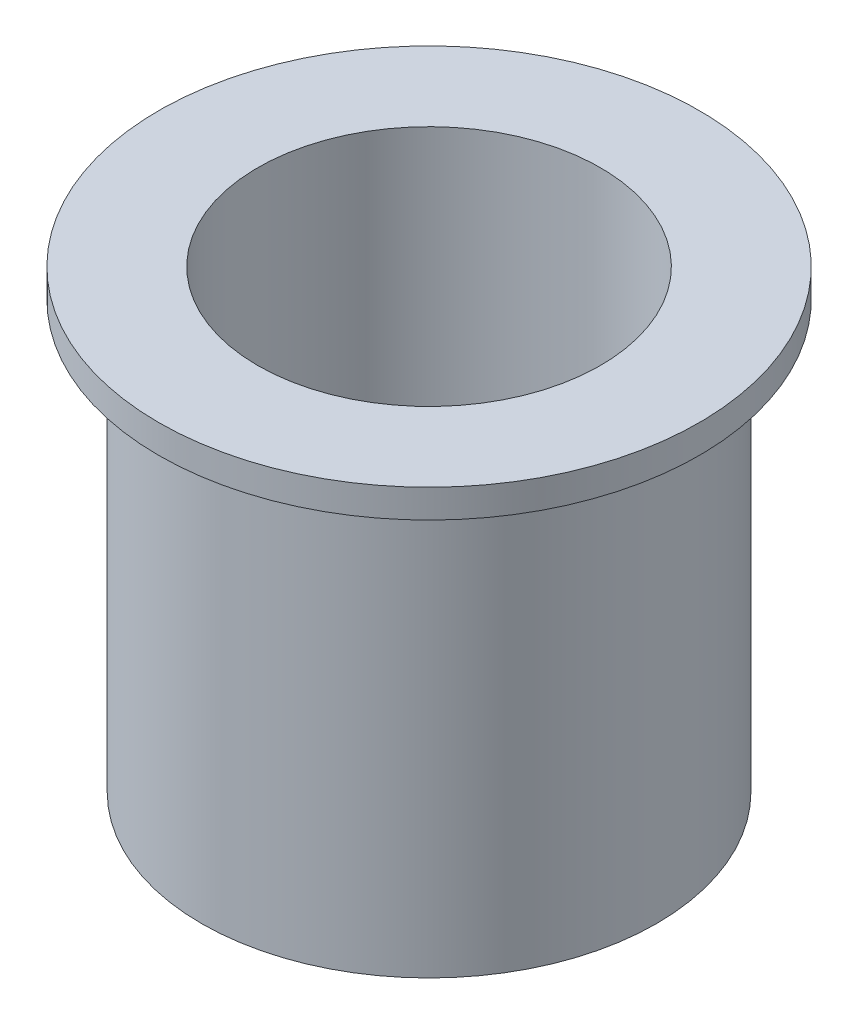
ISO-10303-21;
HEADER;
FILE_DESCRIPTION(('STEP AP214'),'2;1');
FILE_NAME('part.step','',(''),(''),'','','');
FILE_SCHEMA(('AUTOMOTIVE_DESIGN { 1 0 10303 214 1 1 1 1 }'));
ENDSEC;
DATA;
#1=APPLICATION_CONTEXT('core data for automotive mechanical design processes');
#2=APPLICATION_PROTOCOL_DEFINITION('international standard','automotive_design',2000,#1);
#3=PRODUCT_CONTEXT('',#1,'mechanical');
#4=PRODUCT('Part','Part','',(#3));
#5=PRODUCT_RELATED_PRODUCT_CATEGORY('part','',(#4));
#6=PRODUCT_DEFINITION_FORMATION('','',#4);
#7=PRODUCT_DEFINITION_CONTEXT('part definition',#1,'design');
#8=PRODUCT_DEFINITION('design','',#6,#7);
#9=PRODUCT_DEFINITION_SHAPE('','',#8);
#10=(LENGTH_UNIT() NAMED_UNIT(*) SI_UNIT(.MILLI.,.METRE.));
#11=(NAMED_UNIT(*) PLANE_ANGLE_UNIT() SI_UNIT($,.RADIAN.));
#12=(NAMED_UNIT(*) SI_UNIT($,.STERADIAN.) SOLID_ANGLE_UNIT());
#13=UNCERTAINTY_MEASURE_WITH_UNIT(LENGTH_MEASURE(1.E-05),#10,'distance_accuracy_value','');
#14=(GEOMETRIC_REPRESENTATION_CONTEXT(3) GLOBAL_UNCERTAINTY_ASSIGNED_CONTEXT((#13)) GLOBAL_UNIT_ASSIGNED_CONTEXT((#10,
#11,#12)) REPRESENTATION_CONTEXT('',''));
#15=CARTESIAN_POINT('',(0.,0.,0.));
#16=DIRECTION('',(0.,0.,1.));
#17=DIRECTION('',(1.,0.,0.));
#18=AXIS2_PLACEMENT_3D('',#15,#16,#17);
#19=CARTESIAN_POINT('',(0.,12.7,0.));
#20=DIRECTION('',(0.,1.,0.));
#21=DIRECTION('',(0.,0.,1.));
#22=AXIS2_PLACEMENT_3D('',#19,#20,#21);
#23=PLANE('',#22);
#24=CARTESIAN_POINT('',(0.,12.7,0.));
#25=DIRECTION('',(0.,1.,0.));
#26=DIRECTION('',(0.,0.,1.));
#27=AXIS2_PLACEMENT_3D('',#24,#25,#26);
#28=CIRCLE('',#27,9.5631);
#29=CARTESIAN_POINT('',(0.,12.7,9.5631));
#30=VERTEX_POINT('',#29);
#31=EDGE_CURVE('E18',#30,#30,#28,.F.);
#32=ORIENTED_EDGE('',*,*,#31,.T.);
#33=EDGE_LOOP('',(#32));
#34=FACE_BOUND('',#33,.T.);
#35=CARTESIAN_POINT('',(0.,12.7,0.));
#36=DIRECTION('',(0.,1.,0.));
#37=DIRECTION('',(0.,0.,1.));
#38=AXIS2_PLACEMENT_3D('',#35,#36,#37);
#39=CIRCLE('',#38,15.08125);
#40=CARTESIAN_POINT('',(0.,12.7,15.08125));
#41=VERTEX_POINT('',#40);
#42=EDGE_CURVE('E34',#41,#41,#39,.F.);
#43=ORIENTED_EDGE('',*,*,#42,.F.);
#44=EDGE_LOOP('',(#43));
#45=FACE_BOUND('',#44,.T.);
#46=ADVANCED_FACE('F15',(#34,#45),#23,.T.);
#47=CARTESIAN_POINT('',(0.,-12.7,0.));
#48=DIRECTION('',(0.,1.,0.));
#49=DIRECTION('',(0.,0.,1.));
#50=AXIS2_PLACEMENT_3D('',#47,#48,#49);
#51=CYLINDRICAL_SURFACE('',#50,9.5631);
#52=ORIENTED_EDGE('',*,*,#31,.F.);
#53=EDGE_LOOP('',(#52));
#54=FACE_BOUND('',#53,.T.);
#55=CARTESIAN_POINT('',(0.,-12.7,0.));
#56=DIRECTION('',(0.,1.,0.));
#57=DIRECTION('',(0.,0.,1.));
#58=AXIS2_PLACEMENT_3D('',#55,#56,#57);
#59=CIRCLE('',#58,9.5631);
#60=CARTESIAN_POINT('',(0.,-12.7,9.5631));
#61=VERTEX_POINT('',#60);
#62=EDGE_CURVE('E32',#61,#61,#59,.F.);
#63=ORIENTED_EDGE('',*,*,#62,.T.);
#64=EDGE_LOOP('',(#63));
#65=FACE_BOUND('',#64,.T.);
#66=ADVANCED_FACE('F43',(#54,#65),#51,.F.);
#67=CARTESIAN_POINT('',(0.,12.7,0.));
#68=DIRECTION('',(0.,1.,0.));
#69=DIRECTION('',(0.,0.,1.));
#70=AXIS2_PLACEMENT_3D('',#67,#68,#69);
#71=CYLINDRICAL_SURFACE('',#70,15.08125);
#72=CARTESIAN_POINT('',(0.,11.1125,0.));
#73=DIRECTION('',(0.,1.,0.));
#74=DIRECTION('',(0.,0.,1.));
#75=AXIS2_PLACEMENT_3D('',#72,#73,#74);
#76=CIRCLE('',#75,15.08125);
#77=CARTESIAN_POINT('',(0.,11.1125,15.08125));
#78=VERTEX_POINT('',#77);
#79=EDGE_CURVE('E27',#78,#78,#76,.T.);
#80=ORIENTED_EDGE('',*,*,#79,.T.);
#81=EDGE_LOOP('',(#80));
#82=FACE_BOUND('',#81,.T.);
#83=ORIENTED_EDGE('',*,*,#42,.T.);
#84=EDGE_LOOP('',(#83));
#85=FACE_BOUND('',#84,.T.);
#86=ADVANCED_FACE('F46',(#82,#85),#71,.T.);
#87=CARTESIAN_POINT('',(0.,-12.7,0.));
#88=DIRECTION('',(0.,1.,0.));
#89=DIRECTION('',(0.,0.,1.));
#90=AXIS2_PLACEMENT_3D('',#87,#88,#89);
#91=PLANE('',#90);
#92=ORIENTED_EDGE('',*,*,#62,.F.);
#93=EDGE_LOOP('',(#92));
#94=FACE_BOUND('',#93,.T.);
#95=CARTESIAN_POINT('',(0.,-12.7,0.));
#96=DIRECTION('',(0.,1.,0.));
#97=DIRECTION('',(0.,0.,1.));
#98=AXIS2_PLACEMENT_3D('',#95,#96,#97);
#99=CIRCLE('',#98,12.7);
#100=CARTESIAN_POINT('',(0.,-12.7,12.7));
#101=VERTEX_POINT('',#100);
#102=EDGE_CURVE('E22',#101,#101,#99,.T.);
#103=ORIENTED_EDGE('',*,*,#102,.F.);
#104=EDGE_LOOP('',(#103));
#105=FACE_BOUND('',#104,.T.);
#106=ADVANCED_FACE('F49',(#94,#105),#91,.F.);
#107=CARTESIAN_POINT('',(0.,11.1125,0.));
#108=DIRECTION('',(0.,1.,0.));
#109=DIRECTION('',(0.,0.,1.));
#110=AXIS2_PLACEMENT_3D('',#107,#108,#109);
#111=PLANE('',#110);
#112=CARTESIAN_POINT('',(0.,11.1125,0.));
#113=DIRECTION('',(0.,1.,0.));
#114=DIRECTION('',(0.,0.,1.));
#115=AXIS2_PLACEMENT_3D('',#112,#113,#114);
#116=CIRCLE('',#115,12.7);
#117=CARTESIAN_POINT('',(0.,11.1125,12.7));
#118=VERTEX_POINT('',#117);
#119=EDGE_CURVE('E10',#118,#118,#116,.F.);
#120=ORIENTED_EDGE('',*,*,#119,.F.);
#121=EDGE_LOOP('',(#120));
#122=FACE_BOUND('',#121,.T.);
#123=ORIENTED_EDGE('',*,*,#79,.F.);
#124=EDGE_LOOP('',(#123));
#125=FACE_BOUND('',#124,.T.);
#126=ADVANCED_FACE('F52',(#122,#125),#111,.F.);
#127=CARTESIAN_POINT('',(0.,-12.7,0.));
#128=DIRECTION('',(0.,1.,0.));
#129=DIRECTION('',(0.,0.,1.));
#130=AXIS2_PLACEMENT_3D('',#127,#128,#129);
#131=CYLINDRICAL_SURFACE('',#130,12.7);
#132=ORIENTED_EDGE('',*,*,#102,.T.);
#133=EDGE_LOOP('',(#132));
#134=FACE_BOUND('',#133,.T.);
#135=ORIENTED_EDGE('',*,*,#119,.T.);
#136=EDGE_LOOP('',(#135));
#137=FACE_BOUND('',#136,.T.);
#138=ADVANCED_FACE('F56',(#134,#137),#131,.T.);
#139=CLOSED_SHELL('',(#46,#66,#86,#106,#126,#138));
#140=MANIFOLD_SOLID_BREP('B1',#139);
#141=ADVANCED_BREP_SHAPE_REPRESENTATION('',(#18,#140),#14);
#142=SHAPE_DEFINITION_REPRESENTATION(#9,#141);
ENDSEC;
END-ISO-10303-21;
